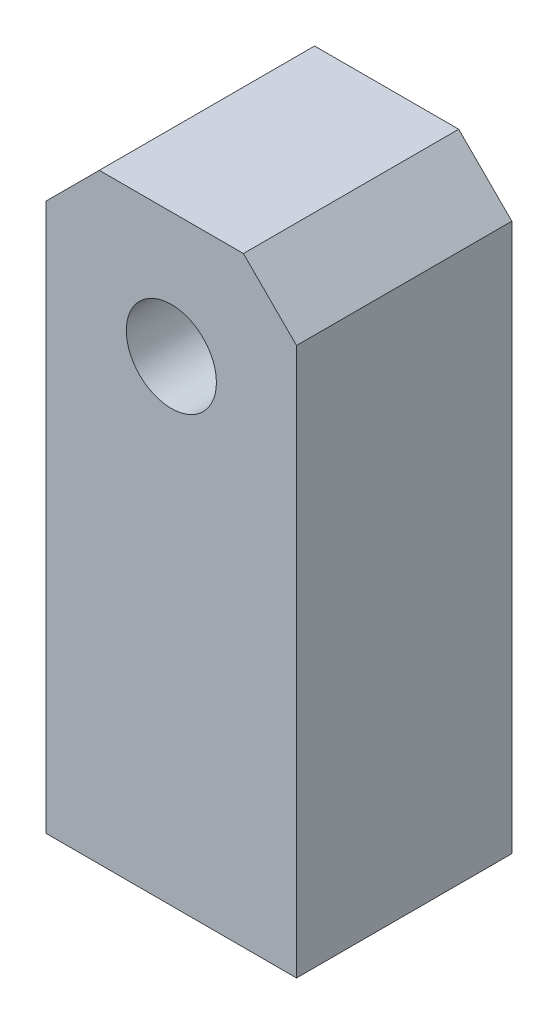
ISO-10303-21;
HEADER;
FILE_DESCRIPTION(('STEP AP214'),'2;1');
FILE_NAME('part.step','',(''),(''),'','','');
FILE_SCHEMA(('AUTOMOTIVE_DESIGN { 1 0 10303 214 1 1 1 1 }'));
ENDSEC;
DATA;
#1=APPLICATION_CONTEXT('core data for automotive mechanical design processes');
#2=APPLICATION_PROTOCOL_DEFINITION('international standard','automotive_design',2000,#1);
#3=PRODUCT_CONTEXT('',#1,'mechanical');
#4=PRODUCT('Part','Part','',(#3));
#5=PRODUCT_RELATED_PRODUCT_CATEGORY('part','',(#4));
#6=PRODUCT_DEFINITION_FORMATION('','',#4);
#7=PRODUCT_DEFINITION_CONTEXT('part definition',#1,'design');
#8=PRODUCT_DEFINITION('design','',#6,#7);
#9=PRODUCT_DEFINITION_SHAPE('','',#8);
#10=(LENGTH_UNIT() NAMED_UNIT(*) SI_UNIT(.MILLI.,.METRE.));
#11=(NAMED_UNIT(*) PLANE_ANGLE_UNIT() SI_UNIT($,.RADIAN.));
#12=(NAMED_UNIT(*) SI_UNIT($,.STERADIAN.) SOLID_ANGLE_UNIT());
#13=UNCERTAINTY_MEASURE_WITH_UNIT(LENGTH_MEASURE(1.E-05),#10,'distance_accuracy_value','');
#14=(GEOMETRIC_REPRESENTATION_CONTEXT(3) GLOBAL_UNCERTAINTY_ASSIGNED_CONTEXT((#13)) GLOBAL_UNIT_ASSIGNED_CONTEXT((#10,
#11,#12)) REPRESENTATION_CONTEXT('',''));
#15=CARTESIAN_POINT('',(0.,0.,0.));
#16=DIRECTION('',(0.,0.,1.));
#17=DIRECTION('',(1.,0.,0.));
#18=AXIS2_PLACEMENT_3D('',#15,#16,#17);
#19=CARTESIAN_POINT('',(-1.9696699141101,1.96966991411008,4.3));
#20=DIRECTION('',(-0.707106781186551,0.707106781186544,0.));
#21=DIRECTION('',(-0.707106781186544,-0.707106781186551,0.));
#22=AXIS2_PLACEMENT_3D('',#19,#20,#21);
#23=PLANE('',#22);
#24=DIRECTION('',(0.707106781186544,0.707106781186551,0.));
#25=VECTOR('',#24,1.);
#26=CARTESIAN_POINT('',(-1.9696699141101,1.96966991411008,0.));
#27=LINE('',#26,#25);
#28=CARTESIAN_POINT('',(-2.5,1.43933982822017,0.));
#29=VERTEX_POINT('',#28);
#30=CARTESIAN_POINT('',(-1.43933982822018,2.5,0.));
#31=VERTEX_POINT('',#30);
#32=EDGE_CURVE('E119',#29,#31,#27,.T.);
#33=ORIENTED_EDGE('',*,*,#32,.F.);
#34=DIRECTION('',(0.,0.,-1.));
#35=VECTOR('',#34,1.);
#36=CARTESIAN_POINT('',(-2.5,1.43933982822017,4.3));
#37=LINE('',#36,#35);
#38=CARTESIAN_POINT('',(-2.5,1.43933982822017,4.3));
#39=VERTEX_POINT('',#38);
#40=EDGE_CURVE('E11',#39,#29,#37,.T.);
#41=ORIENTED_EDGE('',*,*,#40,.F.);
#42=DIRECTION('',(0.707106781186544,0.707106781186551,0.));
#43=VECTOR('',#42,1.);
#44=CARTESIAN_POINT('',(-1.9696699141101,1.96966991411008,4.3));
#45=LINE('',#44,#43);
#46=CARTESIAN_POINT('',(-1.43933982822018,2.5,4.3));
#47=VERTEX_POINT('',#46);
#48=EDGE_CURVE('E170',#39,#47,#45,.T.);
#49=ORIENTED_EDGE('',*,*,#48,.T.);
#50=DIRECTION('',(0.,0.,-1.));
#51=VECTOR('',#50,1.);
#52=CARTESIAN_POINT('',(-1.43933982822018,2.5,4.3));
#53=LINE('',#52,#51);
#54=EDGE_CURVE('E51',#47,#31,#53,.T.);
#55=ORIENTED_EDGE('',*,*,#54,.T.);
#56=EDGE_LOOP('',(#33,#41,#49,#55));
#57=FACE_BOUND('',#56,.T.);
#58=ADVANCED_FACE('F34',(#57),#23,.T.);
#59=CARTESIAN_POINT('',(-2.5,0.,4.3));
#60=DIRECTION('',(1.,0.,0.));
#61=DIRECTION('',(0.,1.,0.));
#62=AXIS2_PLACEMENT_3D('',#59,#60,#61);
#63=PLANE('',#62);
#64=DIRECTION('',(0.,-1.,0.));
#65=VECTOR('',#64,1.);
#66=CARTESIAN_POINT('',(-2.5,0.,0.));
#67=LINE('',#66,#65);
#68=CARTESIAN_POINT('',(-2.5,-9.5,0.));
#69=VERTEX_POINT('',#68);
#70=EDGE_CURVE('E121',#29,#69,#67,.T.);
#71=ORIENTED_EDGE('',*,*,#70,.T.);
#72=DIRECTION('',(0.,0.,-1.));
#73=VECTOR('',#72,1.);
#74=CARTESIAN_POINT('',(-2.5,-9.5,4.3));
#75=LINE('',#74,#73);
#76=CARTESIAN_POINT('',(-2.5,-9.5,4.3));
#77=VERTEX_POINT('',#76);
#78=EDGE_CURVE('E43',#77,#69,#75,.T.);
#79=ORIENTED_EDGE('',*,*,#78,.F.);
#80=DIRECTION('',(0.,-1.,0.));
#81=VECTOR('',#80,1.);
#82=CARTESIAN_POINT('',(-2.5,0.,4.3));
#83=LINE('',#82,#81);
#84=EDGE_CURVE('E172',#39,#77,#83,.T.);
#85=ORIENTED_EDGE('',*,*,#84,.F.);
#86=ORIENTED_EDGE('',*,*,#40,.T.);
#87=EDGE_LOOP('',(#71,#79,#85,#86));
#88=FACE_BOUND('',#87,.T.);
#89=ADVANCED_FACE('F142',(#88),#63,.F.);
#90=CARTESIAN_POINT('',(0.,-9.5,4.3));
#91=DIRECTION('',(0.,1.,0.));
#92=DIRECTION('',(0.,0.,1.));
#93=AXIS2_PLACEMENT_3D('',#90,#91,#92);
#94=PLANE('',#93);
#95=DIRECTION('',(1.,0.,0.));
#96=VECTOR('',#95,1.);
#97=CARTESIAN_POINT('',(0.,-9.5,0.));
#98=LINE('',#97,#96);
#99=CARTESIAN_POINT('',(2.5,-9.5,0.));
#100=VERTEX_POINT('',#99);
#101=EDGE_CURVE('E124',#69,#100,#98,.T.);
#102=ORIENTED_EDGE('',*,*,#101,.T.);
#103=DIRECTION('',(0.,0.,-1.));
#104=VECTOR('',#103,1.);
#105=CARTESIAN_POINT('',(2.5,-9.5,4.3));
#106=LINE('',#105,#104);
#107=CARTESIAN_POINT('',(2.5,-9.5,4.3));
#108=VERTEX_POINT('',#107);
#109=EDGE_CURVE('E98',#108,#100,#106,.T.);
#110=ORIENTED_EDGE('',*,*,#109,.F.);
#111=DIRECTION('',(1.,0.,0.));
#112=VECTOR('',#111,1.);
#113=CARTESIAN_POINT('',(0.,-9.5,4.3));
#114=LINE('',#113,#112);
#115=EDGE_CURVE('E107',#77,#108,#114,.T.);
#116=ORIENTED_EDGE('',*,*,#115,.F.);
#117=ORIENTED_EDGE('',*,*,#78,.T.);
#118=EDGE_LOOP('',(#102,#110,#116,#117));
#119=FACE_BOUND('',#118,.T.);
#120=ADVANCED_FACE('F139',(#119),#94,.F.);
#121=CARTESIAN_POINT('',(2.5,0.,4.3));
#122=DIRECTION('',(1.,0.,0.));
#123=DIRECTION('',(0.,1.,0.));
#124=AXIS2_PLACEMENT_3D('',#121,#122,#123);
#125=PLANE('',#124);
#126=DIRECTION('',(0.,-1.,0.));
#127=VECTOR('',#126,1.);
#128=CARTESIAN_POINT('',(2.5,0.,0.));
#129=LINE('',#128,#127);
#130=CARTESIAN_POINT('',(2.5,1.43933982822017,0.));
#131=VERTEX_POINT('',#130);
#132=EDGE_CURVE('E94',#131,#100,#129,.T.);
#133=ORIENTED_EDGE('',*,*,#132,.F.);
#134=DIRECTION('',(0.,0.,-1.));
#135=VECTOR('',#134,1.);
#136=CARTESIAN_POINT('',(2.5,1.43933982822017,4.3));
#137=LINE('',#136,#135);
#138=CARTESIAN_POINT('',(2.5,1.43933982822017,4.3));
#139=VERTEX_POINT('',#138);
#140=EDGE_CURVE('E89',#139,#131,#137,.T.);
#141=ORIENTED_EDGE('',*,*,#140,.F.);
#142=DIRECTION('',(0.,-1.,0.));
#143=VECTOR('',#142,1.);
#144=CARTESIAN_POINT('',(2.5,0.,4.3));
#145=LINE('',#144,#143);
#146=EDGE_CURVE('E92',#139,#108,#145,.T.);
#147=ORIENTED_EDGE('',*,*,#146,.T.);
#148=ORIENTED_EDGE('',*,*,#109,.T.);
#149=EDGE_LOOP('',(#133,#141,#147,#148));
#150=FACE_BOUND('',#149,.T.);
#151=ADVANCED_FACE('F91',(#150),#125,.T.);
#152=CARTESIAN_POINT('',(1.9696699141101,1.96966991411008,4.3));
#153=DIRECTION('',(0.707106781186551,0.707106781186544,0.));
#154=DIRECTION('',(-0.707106781186544,0.707106781186551,0.));
#155=AXIS2_PLACEMENT_3D('',#152,#153,#154);
#156=PLANE('',#155);
#157=DIRECTION('',(0.707106781186544,-0.707106781186551,0.));
#158=VECTOR('',#157,1.);
#159=CARTESIAN_POINT('',(1.9696699141101,1.96966991411008,0.));
#160=LINE('',#159,#158);
#161=CARTESIAN_POINT('',(1.43933982822018,2.5,0.));
#162=VERTEX_POINT('',#161);
#163=EDGE_CURVE('E128',#162,#131,#160,.T.);
#164=ORIENTED_EDGE('',*,*,#163,.F.);
#165=DIRECTION('',(0.,0.,-1.));
#166=VECTOR('',#165,1.);
#167=CARTESIAN_POINT('',(1.43933982822018,2.5,4.3));
#168=LINE('',#167,#166);
#169=CARTESIAN_POINT('',(1.43933982822018,2.5,4.3));
#170=VERTEX_POINT('',#169);
#171=EDGE_CURVE('E70',#170,#162,#168,.T.);
#172=ORIENTED_EDGE('',*,*,#171,.F.);
#173=DIRECTION('',(0.707106781186544,-0.707106781186551,0.));
#174=VECTOR('',#173,1.);
#175=CARTESIAN_POINT('',(1.9696699141101,1.96966991411008,4.3));
#176=LINE('',#175,#174);
#177=EDGE_CURVE('E105',#170,#139,#176,.T.);
#178=ORIENTED_EDGE('',*,*,#177,.T.);
#179=ORIENTED_EDGE('',*,*,#140,.T.);
#180=EDGE_LOOP('',(#164,#172,#178,#179));
#181=FACE_BOUND('',#180,.T.);
#182=ADVANCED_FACE('F110',(#181),#156,.T.);
#183=CARTESIAN_POINT('',(0.,0.,4.3));
#184=DIRECTION('',(0.,0.,-1.));
#185=DIRECTION('',(-1.,0.,0.));
#186=AXIS2_PLACEMENT_3D('',#183,#184,#185);
#187=CYLINDRICAL_SURFACE('',#186,0.9);
#188=CARTESIAN_POINT('',(0.,0.,4.3));
#189=DIRECTION('',(0.,0.,1.));
#190=DIRECTION('',(1.,0.,0.));
#191=AXIS2_PLACEMENT_3D('',#188,#189,#190);
#192=CIRCLE('',#191,0.9);
#193=CARTESIAN_POINT('',(0.9,0.,4.3));
#194=VERTEX_POINT('',#193);
#195=EDGE_CURVE('E133',#194,#194,#192,.T.);
#196=ORIENTED_EDGE('',*,*,#195,.T.);
#197=EDGE_LOOP('',(#196));
#198=FACE_BOUND('',#197,.T.);
#199=CARTESIAN_POINT('',(0.,0.,0.));
#200=DIRECTION('',(0.,0.,1.));
#201=DIRECTION('',(1.,0.,0.));
#202=AXIS2_PLACEMENT_3D('',#199,#200,#201);
#203=CIRCLE('',#202,0.9);
#204=CARTESIAN_POINT('',(0.9,0.,0.));
#205=VERTEX_POINT('',#204);
#206=EDGE_CURVE('E116',#205,#205,#203,.T.);
#207=ORIENTED_EDGE('',*,*,#206,.F.);
#208=EDGE_LOOP('',(#207));
#209=FACE_BOUND('',#208,.T.);
#210=ADVANCED_FACE('F36',(#198,#209),#187,.F.);
#211=CARTESIAN_POINT('',(0.,2.5,4.3));
#212=DIRECTION('',(0.,1.,0.));
#213=DIRECTION('',(-1.,0.,0.));
#214=AXIS2_PLACEMENT_3D('',#211,#212,#213);
#215=PLANE('',#214);
#216=DIRECTION('',(1.,0.,0.));
#217=VECTOR('',#216,1.);
#218=CARTESIAN_POINT('',(0.,2.5,0.));
#219=LINE('',#218,#217);
#220=EDGE_CURVE('E130',#31,#162,#219,.T.);
#221=ORIENTED_EDGE('',*,*,#220,.F.);
#222=ORIENTED_EDGE('',*,*,#54,.F.);
#223=DIRECTION('',(1.,0.,0.));
#224=VECTOR('',#223,1.);
#225=CARTESIAN_POINT('',(0.,2.5,4.3));
#226=LINE('',#225,#224);
#227=EDGE_CURVE('E111',#47,#170,#226,.T.);
#228=ORIENTED_EDGE('',*,*,#227,.T.);
#229=ORIENTED_EDGE('',*,*,#171,.T.);
#230=EDGE_LOOP('',(#221,#222,#228,#229));
#231=FACE_BOUND('',#230,.T.);
#232=ADVANCED_FACE('F157',(#231),#215,.T.);
#233=CARTESIAN_POINT('',(0.,0.,4.3));
#234=DIRECTION('',(0.,0.,1.));
#235=DIRECTION('',(1.,0.,0.));
#236=AXIS2_PLACEMENT_3D('',#233,#234,#235);
#237=PLANE('',#236);
#238=ORIENTED_EDGE('',*,*,#195,.F.);
#239=EDGE_LOOP('',(#238));
#240=FACE_BOUND('',#239,.T.);
#241=ORIENTED_EDGE('',*,*,#48,.F.);
#242=ORIENTED_EDGE('',*,*,#84,.T.);
#243=ORIENTED_EDGE('',*,*,#115,.T.);
#244=ORIENTED_EDGE('',*,*,#146,.F.);
#245=ORIENTED_EDGE('',*,*,#177,.F.);
#246=ORIENTED_EDGE('',*,*,#227,.F.);
#247=EDGE_LOOP('',(#241,#242,#243,#244,#245,#246));
#248=FACE_BOUND('',#247,.T.);
#249=ADVANCED_FACE('F103',(#240,#248),#237,.T.);
#250=CARTESIAN_POINT('',(0.,0.,0.));
#251=DIRECTION('',(0.,0.,1.));
#252=DIRECTION('',(1.,0.,0.));
#253=AXIS2_PLACEMENT_3D('',#250,#251,#252);
#254=PLANE('',#253);
#255=ORIENTED_EDGE('',*,*,#206,.T.);
#256=EDGE_LOOP('',(#255));
#257=FACE_BOUND('',#256,.T.);
#258=ORIENTED_EDGE('',*,*,#32,.T.);
#259=ORIENTED_EDGE('',*,*,#220,.T.);
#260=ORIENTED_EDGE('',*,*,#163,.T.);
#261=ORIENTED_EDGE('',*,*,#132,.T.);
#262=ORIENTED_EDGE('',*,*,#101,.F.);
#263=ORIENTED_EDGE('',*,*,#70,.F.);
#264=EDGE_LOOP('',(#258,#259,#260,#261,#262,#263));
#265=FACE_BOUND('',#264,.T.);
#266=ADVANCED_FACE('F144',(#257,#265),#254,.F.);
#267=CLOSED_SHELL('',(#58,#89,#120,#151,#182,#210,#232,#249,#266));
#268=MANIFOLD_SOLID_BREP('B2',#267);
#269=ADVANCED_BREP_SHAPE_REPRESENTATION('',(#18,#268),#14);
#270=SHAPE_DEFINITION_REPRESENTATION(#9,#269);
ENDSEC;
END-ISO-10303-21;
